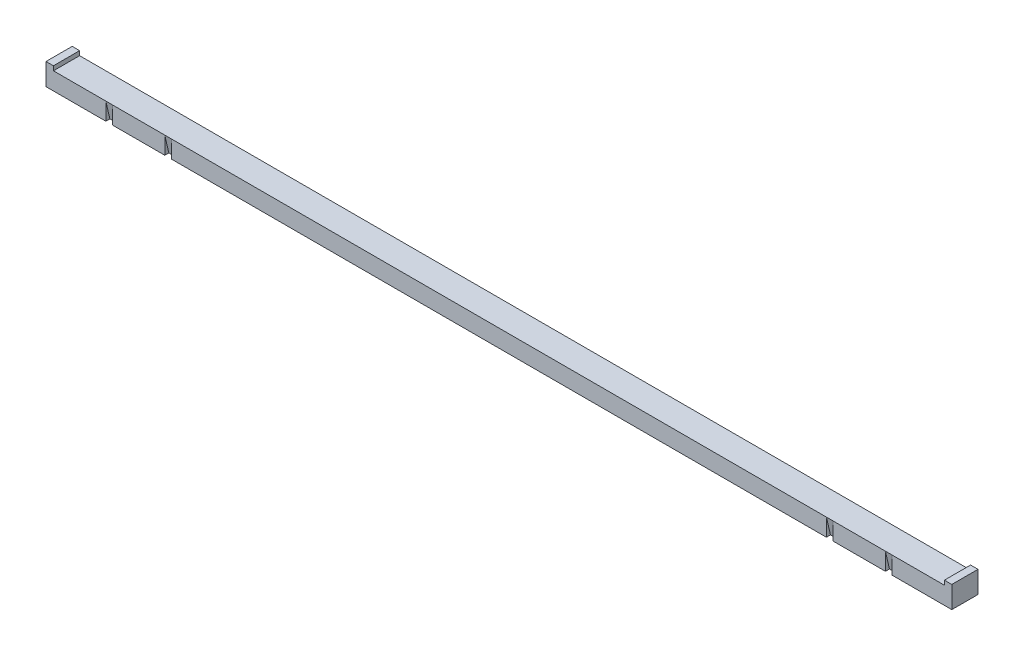
ISO-10303-21;
HEADER;
FILE_DESCRIPTION(('STEP AP214'),'2;1');
FILE_NAME('part.step','',(''),(''),'','','');
FILE_SCHEMA(('AUTOMOTIVE_DESIGN { 1 0 10303 214 1 1 1 1 }'));
ENDSEC;
DATA;
#1=APPLICATION_CONTEXT('core data for automotive mechanical design processes');
#2=APPLICATION_PROTOCOL_DEFINITION('international standard','automotive_design',2000,#1);
#3=PRODUCT_CONTEXT('',#1,'mechanical');
#4=PRODUCT('Part','Part','',(#3));
#5=PRODUCT_RELATED_PRODUCT_CATEGORY('part','',(#4));
#6=PRODUCT_DEFINITION_FORMATION('','',#4);
#7=PRODUCT_DEFINITION_CONTEXT('part definition',#1,'design');
#8=PRODUCT_DEFINITION('design','',#6,#7);
#9=PRODUCT_DEFINITION_SHAPE('','',#8);
#10=(LENGTH_UNIT() NAMED_UNIT(*) SI_UNIT(.MILLI.,.METRE.));
#11=(NAMED_UNIT(*) PLANE_ANGLE_UNIT() SI_UNIT($,.RADIAN.));
#12=(NAMED_UNIT(*) SI_UNIT($,.STERADIAN.) SOLID_ANGLE_UNIT());
#13=UNCERTAINTY_MEASURE_WITH_UNIT(LENGTH_MEASURE(1.E-05),#10,'distance_accuracy_value','');
#14=(GEOMETRIC_REPRESENTATION_CONTEXT(3) GLOBAL_UNCERTAINTY_ASSIGNED_CONTEXT((#13)) GLOBAL_UNIT_ASSIGNED_CONTEXT((#10,
#11,#12)) REPRESENTATION_CONTEXT('',''));
#15=CARTESIAN_POINT('',(0.,0.,0.));
#16=DIRECTION('',(0.,0.,1.));
#17=DIRECTION('',(1.,0.,0.));
#18=AXIS2_PLACEMENT_3D('',#15,#16,#17);
#19=CARTESIAN_POINT('',(0.,50.8,0.));
#20=DIRECTION('',(0.,1.,0.));
#21=DIRECTION('',(0.,0.,1.));
#22=AXIS2_PLACEMENT_3D('',#19,#20,#21);
#23=PLANE('',#22);
#24=DIRECTION('',(1.,0.,0.));
#25=VECTOR('',#24,1.);
#26=CARTESIAN_POINT('',(-1316.99,50.8,38.1));
#27=LINE('',#26,#25);
#28=CARTESIAN_POINT('',(1143.,50.8,38.1));
#29=VERTEX_POINT('',#28);
#30=CARTESIAN_POINT('',(1295.4,50.8,38.1));
#31=VERTEX_POINT('',#30);
#32=EDGE_CURVE('E55',#29,#31,#27,.T.);
#33=ORIENTED_EDGE('',*,*,#32,.T.);
#34=DIRECTION('',(0.,0.,1.));
#35=VECTOR('',#34,1.);
#36=CARTESIAN_POINT('',(1295.4,50.8,-38.1));
#37=LINE('',#36,#35);
#38=CARTESIAN_POINT('',(1295.4,50.8,-38.1));
#39=VERTEX_POINT('',#38);
#40=EDGE_CURVE('E50',#39,#31,#37,.T.);
#41=ORIENTED_EDGE('',*,*,#40,.F.);
#42=DIRECTION('',(-1.,0.,0.));
#43=VECTOR('',#42,1.);
#44=CARTESIAN_POINT('',(-1316.99,50.8,-38.1));
#45=LINE('',#44,#43);
#46=CARTESIAN_POINT('',(-1295.4,50.8,-38.1));
#47=VERTEX_POINT('',#46);
#48=EDGE_CURVE('E277',#39,#47,#45,.T.);
#49=ORIENTED_EDGE('',*,*,#48,.T.);
#50=DIRECTION('',(0.,0.,-1.));
#51=VECTOR('',#50,1.);
#52=CARTESIAN_POINT('',(-1295.4,50.8,-38.1));
#53=LINE('',#52,#51);
#54=CARTESIAN_POINT('',(-1295.4,50.8,38.1));
#55=VERTEX_POINT('',#54);
#56=EDGE_CURVE('E205',#55,#47,#53,.T.);
#57=ORIENTED_EDGE('',*,*,#56,.F.);
#58=CARTESIAN_POINT('',(-1143.,50.8,38.1));
#59=VERTEX_POINT('',#58);
#60=EDGE_CURVE('E280',#55,#59,#27,.T.);
#61=ORIENTED_EDGE('',*,*,#60,.T.);
#62=DIRECTION('',(-1.,0.,0.));
#63=VECTOR('',#62,1.);
#64=CARTESIAN_POINT('',(-1143.,50.8,38.1));
#65=LINE('',#64,#63);
#66=CARTESIAN_POINT('',(-1123.95,50.8,38.1));
#67=VERTEX_POINT('',#66);
#68=EDGE_CURVE('E228',#67,#59,#65,.T.);
#69=ORIENTED_EDGE('',*,*,#68,.F.);
#70=CARTESIAN_POINT('',(-971.55,50.8,38.1));
#71=VERTEX_POINT('',#70);
#72=EDGE_CURVE('E283',#67,#71,#27,.T.);
#73=ORIENTED_EDGE('',*,*,#72,.T.);
#74=DIRECTION('',(-1.,0.,0.));
#75=VECTOR('',#74,1.);
#76=CARTESIAN_POINT('',(-971.55,50.8,38.1));
#77=LINE('',#76,#75);
#78=CARTESIAN_POINT('',(-952.5,50.8,38.1));
#79=VERTEX_POINT('',#78);
#80=EDGE_CURVE('E238',#79,#71,#77,.T.);
#81=ORIENTED_EDGE('',*,*,#80,.F.);
#82=CARTESIAN_POINT('',(952.5,50.8,38.1));
#83=VERTEX_POINT('',#82);
#84=EDGE_CURVE('E381',#79,#83,#27,.T.);
#85=ORIENTED_EDGE('',*,*,#84,.T.);
#86=DIRECTION('',(-1.,0.,0.));
#87=VECTOR('',#86,1.);
#88=CARTESIAN_POINT('',(952.5,50.8,38.1));
#89=LINE('',#88,#87);
#90=CARTESIAN_POINT('',(971.55,50.8,38.1));
#91=VERTEX_POINT('',#90);
#92=EDGE_CURVE('E245',#91,#83,#89,.T.);
#93=ORIENTED_EDGE('',*,*,#92,.F.);
#94=CARTESIAN_POINT('',(1123.95,50.8,38.1));
#95=VERTEX_POINT('',#94);
#96=EDGE_CURVE('E383',#91,#95,#27,.T.);
#97=ORIENTED_EDGE('',*,*,#96,.T.);
#98=DIRECTION('',(-1.,0.,0.));
#99=VECTOR('',#98,1.);
#100=CARTESIAN_POINT('',(1123.95,50.8,38.1));
#101=LINE('',#100,#99);
#102=EDGE_CURVE('E251',#29,#95,#101,.T.);
#103=ORIENTED_EDGE('',*,*,#102,.F.);
#104=EDGE_LOOP('',(#33,#41,#49,#57,#61,#69,#73,#81,#85,#93,#97,#103));
#105=FACE_BOUND('',#104,.T.);
#106=ADVANCED_FACE('F35',(#105),#23,.T.);
#107=CARTESIAN_POINT('',(-1316.99,50.8,38.1));
#108=DIRECTION('',(0.,0.,-1.));
#109=DIRECTION('',(-1.,0.,0.));
#110=AXIS2_PLACEMENT_3D('',#107,#108,#109);
#111=PLANE('',#110);
#112=ORIENTED_EDGE('',*,*,#72,.F.);
#113=DIRECTION('',(0.,-1.,0.));
#114=VECTOR('',#113,1.);
#115=CARTESIAN_POINT('',(-1123.95,50.8,38.1));
#116=LINE('',#115,#114);
#117=CARTESIAN_POINT('',(-1123.95,0.,38.1));
#118=VERTEX_POINT('',#117);
#119=EDGE_CURVE('E274',#67,#118,#116,.T.);
#120=ORIENTED_EDGE('',*,*,#119,.T.);
#121=DIRECTION('',(1.,0.,0.));
#122=VECTOR('',#121,1.);
#123=CARTESIAN_POINT('',(-1316.99,0.,38.1));
#124=LINE('',#123,#122);
#125=CARTESIAN_POINT('',(-971.55,0.,38.1));
#126=VERTEX_POINT('',#125);
#127=EDGE_CURVE('E292',#118,#126,#124,.T.);
#128=ORIENTED_EDGE('',*,*,#127,.T.);
#129=DIRECTION('',(0.,1.,0.));
#130=VECTOR('',#129,1.);
#131=CARTESIAN_POINT('',(-971.55,50.8,38.1));
#132=LINE('',#131,#130);
#133=EDGE_CURVE('E265',#126,#71,#132,.T.);
#134=ORIENTED_EDGE('',*,*,#133,.T.);
#135=EDGE_LOOP('',(#112,#120,#128,#134));
#136=FACE_BOUND('',#135,.T.);
#137=ADVANCED_FACE('F367',(#136),#111,.F.);
#138=ORIENTED_EDGE('',*,*,#84,.F.);
#139=DIRECTION('',(0.,-1.,0.));
#140=VECTOR('',#139,1.);
#141=CARTESIAN_POINT('',(-952.5,50.8,38.1));
#142=LINE('',#141,#140);
#143=CARTESIAN_POINT('',(-952.5,0.,38.1));
#144=VERTEX_POINT('',#143);
#145=EDGE_CURVE('E268',#79,#144,#142,.T.);
#146=ORIENTED_EDGE('',*,*,#145,.T.);
#147=CARTESIAN_POINT('',(952.5,0.,38.1));
#148=VERTEX_POINT('',#147);
#149=EDGE_CURVE('E358',#144,#148,#124,.T.);
#150=ORIENTED_EDGE('',*,*,#149,.T.);
#151=DIRECTION('',(0.,1.,0.));
#152=VECTOR('',#151,1.);
#153=CARTESIAN_POINT('',(952.5,50.8,38.1));
#154=LINE('',#153,#152);
#155=EDGE_CURVE('E262',#148,#83,#154,.T.);
#156=ORIENTED_EDGE('',*,*,#155,.T.);
#157=EDGE_LOOP('',(#138,#146,#150,#156));
#158=FACE_BOUND('',#157,.T.);
#159=ADVANCED_FACE('F410',(#158),#111,.F.);
#160=CARTESIAN_POINT('',(-1316.99,0.,38.1));
#161=VERTEX_POINT('',#160);
#162=CARTESIAN_POINT('',(-1143.,0.,38.1));
#163=VERTEX_POINT('',#162);
#164=EDGE_CURVE('E279',#161,#163,#124,.T.);
#165=ORIENTED_EDGE('',*,*,#164,.T.);
#166=DIRECTION('',(0.,1.,0.));
#167=VECTOR('',#166,1.);
#168=CARTESIAN_POINT('',(-1143.,50.8,38.1));
#169=LINE('',#168,#167);
#170=EDGE_CURVE('E271',#163,#59,#169,.T.);
#171=ORIENTED_EDGE('',*,*,#170,.T.);
#172=ORIENTED_EDGE('',*,*,#60,.F.);
#173=DIRECTION('',(0.,-1.,0.));
#174=VECTOR('',#173,1.);
#175=CARTESIAN_POINT('',(-1295.4,63.5,38.1));
#176=LINE('',#175,#174);
#177=CARTESIAN_POINT('',(-1295.4,63.5,38.1));
#178=VERTEX_POINT('',#177);
#179=EDGE_CURVE('E221',#178,#55,#176,.T.);
#180=ORIENTED_EDGE('',*,*,#179,.F.);
#181=DIRECTION('',(1.,0.,0.));
#182=VECTOR('',#181,1.);
#183=CARTESIAN_POINT('',(-1295.4,63.5,38.1));
#184=LINE('',#183,#182);
#185=CARTESIAN_POINT('',(-1316.99,63.5,38.1));
#186=VERTEX_POINT('',#185);
#187=EDGE_CURVE('E209',#186,#178,#184,.T.);
#188=ORIENTED_EDGE('',*,*,#187,.F.);
#189=DIRECTION('',(0.,-1.,0.));
#190=VECTOR('',#189,1.);
#191=CARTESIAN_POINT('',(-1316.99,50.8,38.1));
#192=LINE('',#191,#190);
#193=EDGE_CURVE('E294',#186,#161,#192,.T.);
#194=ORIENTED_EDGE('',*,*,#193,.T.);
#195=EDGE_LOOP('',(#165,#171,#172,#180,#188,#194));
#196=FACE_BOUND('',#195,.T.);
#197=ADVANCED_FACE('F336',(#196),#111,.F.);
#198=ORIENTED_EDGE('',*,*,#96,.F.);
#199=DIRECTION('',(0.,-1.,0.));
#200=VECTOR('',#199,1.);
#201=CARTESIAN_POINT('',(971.55,50.8,38.1));
#202=LINE('',#201,#200);
#203=CARTESIAN_POINT('',(971.55,0.,38.1));
#204=VERTEX_POINT('',#203);
#205=EDGE_CURVE('E259',#91,#204,#202,.T.);
#206=ORIENTED_EDGE('',*,*,#205,.T.);
#207=CARTESIAN_POINT('',(1123.95,0.,38.1));
#208=VERTEX_POINT('',#207);
#209=EDGE_CURVE('E356',#204,#208,#124,.T.);
#210=ORIENTED_EDGE('',*,*,#209,.T.);
#211=DIRECTION('',(0.,1.,0.));
#212=VECTOR('',#211,1.);
#213=CARTESIAN_POINT('',(1123.95,50.8,38.1));
#214=LINE('',#213,#212);
#215=EDGE_CURVE('E256',#208,#95,#214,.T.);
#216=ORIENTED_EDGE('',*,*,#215,.T.);
#217=EDGE_LOOP('',(#198,#206,#210,#216));
#218=FACE_BOUND('',#217,.T.);
#219=ADVANCED_FACE('F386',(#218),#111,.F.);
#220=CARTESIAN_POINT('',(1316.99,50.8,-38.1));
#221=DIRECTION('',(-1.,0.,0.));
#222=DIRECTION('',(0.,0.,1.));
#223=AXIS2_PLACEMENT_3D('',#220,#221,#222);
#224=PLANE('',#223);
#225=DIRECTION('',(0.,0.,-1.));
#226=VECTOR('',#225,1.);
#227=CARTESIAN_POINT('',(1316.99,0.,-38.1));
#228=LINE('',#227,#226);
#229=CARTESIAN_POINT('',(1316.99,0.,38.1));
#230=VERTEX_POINT('',#229);
#231=CARTESIAN_POINT('',(1316.99,0.,-38.1));
#232=VERTEX_POINT('',#231);
#233=EDGE_CURVE('E178',#230,#232,#228,.T.);
#234=ORIENTED_EDGE('',*,*,#233,.T.);
#235=DIRECTION('',(0.,-1.,0.));
#236=VECTOR('',#235,1.);
#237=CARTESIAN_POINT('',(1316.99,50.8,-38.1));
#238=LINE('',#237,#236);
#239=CARTESIAN_POINT('',(1316.99,63.5,-38.1));
#240=VERTEX_POINT('',#239);
#241=EDGE_CURVE('E172',#240,#232,#238,.T.);
#242=ORIENTED_EDGE('',*,*,#241,.F.);
#243=DIRECTION('',(0.,0.,-1.));
#244=VECTOR('',#243,1.);
#245=CARTESIAN_POINT('',(1316.99,63.5,-38.1));
#246=LINE('',#245,#244);
#247=CARTESIAN_POINT('',(1316.99,63.5,38.1));
#248=VERTEX_POINT('',#247);
#249=EDGE_CURVE('E176',#248,#240,#246,.T.);
#250=ORIENTED_EDGE('',*,*,#249,.F.);
#251=DIRECTION('',(0.,-1.,0.));
#252=VECTOR('',#251,1.);
#253=CARTESIAN_POINT('',(1316.99,50.8,38.1));
#254=LINE('',#253,#252);
#255=EDGE_CURVE('E282',#248,#230,#254,.T.);
#256=ORIENTED_EDGE('',*,*,#255,.T.);
#257=EDGE_LOOP('',(#234,#242,#250,#256));
#258=FACE_BOUND('',#257,.T.);
#259=ADVANCED_FACE('F37',(#258),#224,.F.);
#260=CARTESIAN_POINT('',(-1316.99,50.8,-38.1));
#261=DIRECTION('',(0.,0.,1.));
#262=DIRECTION('',(1.,0.,0.));
#263=AXIS2_PLACEMENT_3D('',#260,#261,#262);
#264=PLANE('',#263);
#265=DIRECTION('',(-1.,0.,0.));
#266=VECTOR('',#265,1.);
#267=CARTESIAN_POINT('',(-1316.99,0.,-38.1));
#268=LINE('',#267,#266);
#269=CARTESIAN_POINT('',(-1316.99,0.,-38.1));
#270=VERTEX_POINT('',#269);
#271=EDGE_CURVE('E285',#232,#270,#268,.T.);
#272=ORIENTED_EDGE('',*,*,#271,.T.);
#273=DIRECTION('',(0.,-1.,0.));
#274=VECTOR('',#273,1.);
#275=CARTESIAN_POINT('',(-1316.99,50.8,-38.1));
#276=LINE('',#275,#274);
#277=CARTESIAN_POINT('',(-1316.99,63.5,-38.1));
#278=VERTEX_POINT('',#277);
#279=EDGE_CURVE('E181',#278,#270,#276,.T.);
#280=ORIENTED_EDGE('',*,*,#279,.F.);
#281=DIRECTION('',(-1.,0.,0.));
#282=VECTOR('',#281,1.);
#283=CARTESIAN_POINT('',(-1295.4,63.5,-38.1));
#284=LINE('',#283,#282);
#285=CARTESIAN_POINT('',(-1295.4,63.5,-38.1));
#286=VERTEX_POINT('',#285);
#287=EDGE_CURVE('E213',#286,#278,#284,.T.);
#288=ORIENTED_EDGE('',*,*,#287,.F.);
#289=DIRECTION('',(0.,-1.,0.));
#290=VECTOR('',#289,1.);
#291=CARTESIAN_POINT('',(-1295.4,63.5,-38.1));
#292=LINE('',#291,#290);
#293=EDGE_CURVE('E216',#286,#47,#292,.T.);
#294=ORIENTED_EDGE('',*,*,#293,.T.);
#295=ORIENTED_EDGE('',*,*,#48,.F.);
#296=DIRECTION('',(0.,-1.,0.));
#297=VECTOR('',#296,1.);
#298=CARTESIAN_POINT('',(1295.4,63.5,-38.1));
#299=LINE('',#298,#297);
#300=CARTESIAN_POINT('',(1295.4,63.5,-38.1));
#301=VERTEX_POINT('',#300);
#302=EDGE_CURVE('E187',#301,#39,#299,.T.);
#303=ORIENTED_EDGE('',*,*,#302,.F.);
#304=DIRECTION('',(-1.,0.,0.));
#305=VECTOR('',#304,1.);
#306=CARTESIAN_POINT('',(1295.4,63.5,-38.1));
#307=LINE('',#306,#305);
#308=EDGE_CURVE('E184',#240,#301,#307,.T.);
#309=ORIENTED_EDGE('',*,*,#308,.F.);
#310=ORIENTED_EDGE('',*,*,#241,.T.);
#311=EDGE_LOOP('',(#272,#280,#288,#294,#295,#303,#309,#310));
#312=FACE_BOUND('',#311,.T.);
#313=ADVANCED_FACE('F185',(#312),#264,.F.);
#314=CARTESIAN_POINT('',(-1316.99,50.8,-38.1));
#315=DIRECTION('',(1.,0.,0.));
#316=DIRECTION('',(0.,0.,-1.));
#317=AXIS2_PLACEMENT_3D('',#314,#315,#316);
#318=PLANE('',#317);
#319=DIRECTION('',(0.,0.,1.));
#320=VECTOR('',#319,1.);
#321=CARTESIAN_POINT('',(-1316.99,0.,-38.1));
#322=LINE('',#321,#320);
#323=EDGE_CURVE('E287',#270,#161,#322,.T.);
#324=ORIENTED_EDGE('',*,*,#323,.T.);
#325=ORIENTED_EDGE('',*,*,#193,.F.);
#326=DIRECTION('',(0.,0.,1.));
#327=VECTOR('',#326,1.);
#328=CARTESIAN_POINT('',(-1316.99,63.5,-38.1));
#329=LINE('',#328,#327);
#330=EDGE_CURVE('E206',#278,#186,#329,.T.);
#331=ORIENTED_EDGE('',*,*,#330,.F.);
#332=ORIENTED_EDGE('',*,*,#279,.T.);
#333=EDGE_LOOP('',(#324,#325,#331,#332));
#334=FACE_BOUND('',#333,.T.);
#335=ADVANCED_FACE('F342',(#334),#318,.F.);
#336=ORIENTED_EDGE('',*,*,#32,.F.);
#337=DIRECTION('',(0.,-1.,0.));
#338=VECTOR('',#337,1.);
#339=CARTESIAN_POINT('',(1143.,50.8,38.1));
#340=LINE('',#339,#338);
#341=CARTESIAN_POINT('',(1143.,0.,38.1));
#342=VERTEX_POINT('',#341);
#343=EDGE_CURVE('E234',#29,#342,#340,.T.);
#344=ORIENTED_EDGE('',*,*,#343,.T.);
#345=EDGE_CURVE('E289',#342,#230,#124,.T.);
#346=ORIENTED_EDGE('',*,*,#345,.T.);
#347=ORIENTED_EDGE('',*,*,#255,.F.);
#348=DIRECTION('',(1.,0.,0.));
#349=VECTOR('',#348,1.);
#350=CARTESIAN_POINT('',(1295.4,63.5,38.1));
#351=LINE('',#350,#349);
#352=CARTESIAN_POINT('',(1295.4,63.5,38.1));
#353=VERTEX_POINT('',#352);
#354=EDGE_CURVE('E195',#353,#248,#351,.T.);
#355=ORIENTED_EDGE('',*,*,#354,.F.);
#356=DIRECTION('',(0.,-1.,0.));
#357=VECTOR('',#356,1.);
#358=CARTESIAN_POINT('',(1295.4,63.5,38.1));
#359=LINE('',#358,#357);
#360=EDGE_CURVE('E200',#353,#31,#359,.T.);
#361=ORIENTED_EDGE('',*,*,#360,.T.);
#362=EDGE_LOOP('',(#336,#344,#346,#347,#355,#361));
#363=FACE_BOUND('',#362,.T.);
#364=ADVANCED_FACE('F355',(#363),#111,.F.);
#365=CARTESIAN_POINT('',(0.,0.,0.));
#366=DIRECTION('',(0.,1.,0.));
#367=DIRECTION('',(0.,0.,1.));
#368=AXIS2_PLACEMENT_3D('',#365,#366,#367);
#369=PLANE('',#368);
#370=ORIENTED_EDGE('',*,*,#127,.F.);
#371=DIRECTION('',(0.,0.,-1.));
#372=VECTOR('',#371,1.);
#373=CARTESIAN_POINT('',(-1123.95,0.,0.));
#374=LINE('',#373,#372);
#375=CARTESIAN_POINT('',(-1123.95,0.,26.3718958908212));
#376=VERTEX_POINT('',#375);
#377=EDGE_CURVE('E11',#118,#376,#374,.T.);
#378=ORIENTED_EDGE('',*,*,#377,.T.);
#379=DIRECTION('',(1.,0.,0.));
#380=VECTOR('',#379,1.);
#381=CARTESIAN_POINT('',(0.,0.,26.3718958908212));
#382=LINE('',#381,#380);
#383=CARTESIAN_POINT('',(-1143.,0.,26.3718958908212));
#384=VERTEX_POINT('',#383);
#385=EDGE_CURVE('E324',#384,#376,#382,.T.);
#386=ORIENTED_EDGE('',*,*,#385,.F.);
#387=DIRECTION('',(0.,0.,1.));
#388=VECTOR('',#387,1.);
#389=CARTESIAN_POINT('',(-1143.,0.,0.));
#390=LINE('',#389,#388);
#391=EDGE_CURVE('E43',#384,#163,#390,.T.);
#392=ORIENTED_EDGE('',*,*,#391,.T.);
#393=ORIENTED_EDGE('',*,*,#164,.F.);
#394=ORIENTED_EDGE('',*,*,#323,.F.);
#395=ORIENTED_EDGE('',*,*,#271,.F.);
#396=ORIENTED_EDGE('',*,*,#233,.F.);
#397=ORIENTED_EDGE('',*,*,#345,.F.);
#398=DIRECTION('',(0.,0.,-1.));
#399=VECTOR('',#398,1.);
#400=CARTESIAN_POINT('',(1143.,0.,0.));
#401=LINE('',#400,#399);
#402=CARTESIAN_POINT('',(1143.,0.,26.3718958908212));
#403=VERTEX_POINT('',#402);
#404=EDGE_CURVE('E301',#342,#403,#401,.T.);
#405=ORIENTED_EDGE('',*,*,#404,.T.);
#406=DIRECTION('',(-1.,0.,0.));
#407=VECTOR('',#406,1.);
#408=CARTESIAN_POINT('',(0.,0.,26.3718958908212));
#409=LINE('',#408,#407);
#410=CARTESIAN_POINT('',(1123.95,0.,26.3718958908212));
#411=VERTEX_POINT('',#410);
#412=EDGE_CURVE('E180',#403,#411,#409,.T.);
#413=ORIENTED_EDGE('',*,*,#412,.T.);
#414=DIRECTION('',(0.,0.,1.));
#415=VECTOR('',#414,1.);
#416=CARTESIAN_POINT('',(1123.95,0.,0.));
#417=LINE('',#416,#415);
#418=EDGE_CURVE('E304',#411,#208,#417,.T.);
#419=ORIENTED_EDGE('',*,*,#418,.T.);
#420=ORIENTED_EDGE('',*,*,#209,.F.);
#421=DIRECTION('',(0.,0.,-1.));
#422=VECTOR('',#421,1.);
#423=CARTESIAN_POINT('',(971.55,0.,0.));
#424=LINE('',#423,#422);
#425=CARTESIAN_POINT('',(971.55,0.,26.3718958908212));
#426=VERTEX_POINT('',#425);
#427=EDGE_CURVE('E310',#204,#426,#424,.T.);
#428=ORIENTED_EDGE('',*,*,#427,.T.);
#429=DIRECTION('',(-1.,0.,0.));
#430=VECTOR('',#429,1.);
#431=CARTESIAN_POINT('',(0.,0.,26.3718958908212));
#432=LINE('',#431,#430);
#433=CARTESIAN_POINT('',(952.5,0.,26.3718958908212));
#434=VERTEX_POINT('',#433);
#435=EDGE_CURVE('E307',#426,#434,#432,.T.);
#436=ORIENTED_EDGE('',*,*,#435,.T.);
#437=DIRECTION('',(0.,0.,1.));
#438=VECTOR('',#437,1.);
#439=CARTESIAN_POINT('',(952.5,0.,0.));
#440=LINE('',#439,#438);
#441=EDGE_CURVE('E313',#434,#148,#440,.T.);
#442=ORIENTED_EDGE('',*,*,#441,.T.);
#443=ORIENTED_EDGE('',*,*,#149,.F.);
#444=DIRECTION('',(0.,0.,-1.));
#445=VECTOR('',#444,1.);
#446=CARTESIAN_POINT('',(-952.5,0.,0.));
#447=LINE('',#446,#445);
#448=CARTESIAN_POINT('',(-952.5,0.,26.3718958908212));
#449=VERTEX_POINT('',#448);
#450=EDGE_CURVE('E321',#144,#449,#447,.T.);
#451=ORIENTED_EDGE('',*,*,#450,.T.);
#452=DIRECTION('',(1.,0.,0.));
#453=VECTOR('',#452,1.);
#454=CARTESIAN_POINT('',(0.,0.,26.3718958908212));
#455=LINE('',#454,#453);
#456=CARTESIAN_POINT('',(-971.55,0.,26.3718958908212));
#457=VERTEX_POINT('',#456);
#458=EDGE_CURVE('E316',#457,#449,#455,.T.);
#459=ORIENTED_EDGE('',*,*,#458,.F.);
#460=DIRECTION('',(0.,0.,1.));
#461=VECTOR('',#460,1.);
#462=CARTESIAN_POINT('',(-971.55,0.,0.));
#463=LINE('',#462,#461);
#464=EDGE_CURVE('E318',#457,#126,#463,.T.);
#465=ORIENTED_EDGE('',*,*,#464,.T.);
#466=EDGE_LOOP('',(#370,#378,#386,#392,#393,#394,#395,#396,#397,#405,#413,#419,#420,#428,#436,
#442,#443,#451,#459,#465));
#467=FACE_BOUND('',#466,.T.);
#468=ADVANCED_FACE('F331',(#467),#369,.F.);
#469=CARTESIAN_POINT('',(1123.95,50.8,38.1));
#470=DIRECTION('',(-1.,0.,0.));
#471=DIRECTION('',(0.,0.,1.));
#472=AXIS2_PLACEMENT_3D('',#469,#470,#471);
#473=PLANE('',#472);
#474=ORIENTED_EDGE('',*,*,#418,.F.);
#475=DIRECTION('',(0.,-0.974370064785234,-0.224951054343869));
#476=VECTOR('',#475,1.);
#477=CARTESIAN_POINT('',(1123.95,50.8,38.1));
#478=LINE('',#477,#476);
#479=EDGE_CURVE('E246',#95,#411,#478,.T.);
#480=ORIENTED_EDGE('',*,*,#479,.F.);
#481=ORIENTED_EDGE('',*,*,#215,.F.);
#482=EDGE_LOOP('',(#474,#480,#481));
#483=FACE_BOUND('',#482,.T.);
#484=ADVANCED_FACE('F390',(#483),#473,.F.);
#485=CARTESIAN_POINT('',(1143.,50.8,38.1));
#486=DIRECTION('',(1.,0.,0.));
#487=DIRECTION('',(0.,0.,-1.));
#488=AXIS2_PLACEMENT_3D('',#485,#486,#487);
#489=PLANE('',#488);
#490=DIRECTION('',(0.,0.974370064785234,0.224951054343869));
#491=VECTOR('',#490,1.);
#492=CARTESIAN_POINT('',(1143.,50.8,38.1));
#493=LINE('',#492,#491);
#494=EDGE_CURVE('E224',#403,#29,#493,.T.);
#495=ORIENTED_EDGE('',*,*,#494,.F.);
#496=ORIENTED_EDGE('',*,*,#404,.F.);
#497=ORIENTED_EDGE('',*,*,#343,.F.);
#498=EDGE_LOOP('',(#495,#496,#497));
#499=FACE_BOUND('',#498,.T.);
#500=ADVANCED_FACE('F395',(#499),#489,.F.);
#501=CARTESIAN_POINT('',(0.,87.9234994683174,46.6706351705014));
#502=DIRECTION('',(0.,0.224951054343869,-0.974370064785234));
#503=DIRECTION('',(0.,0.974370064785234,0.224951054343869));
#504=AXIS2_PLACEMENT_3D('',#501,#502,#503);
#505=PLANE('',#504);
#506=ORIENTED_EDGE('',*,*,#494,.T.);
#507=ORIENTED_EDGE('',*,*,#102,.T.);
#508=ORIENTED_EDGE('',*,*,#479,.T.);
#509=ORIENTED_EDGE('',*,*,#412,.F.);
#510=EDGE_LOOP('',(#506,#507,#508,#509));
#511=FACE_BOUND('',#510,.T.);
#512=ADVANCED_FACE('F393',(#511),#505,.F.);
#513=CARTESIAN_POINT('',(952.5,50.8,38.1));
#514=DIRECTION('',(-1.,0.,0.));
#515=DIRECTION('',(0.,0.,1.));
#516=AXIS2_PLACEMENT_3D('',#513,#514,#515);
#517=PLANE('',#516);
#518=ORIENTED_EDGE('',*,*,#441,.F.);
#519=DIRECTION('',(0.,-0.974370064785234,-0.224951054343869));
#520=VECTOR('',#519,1.);
#521=CARTESIAN_POINT('',(952.5,50.8,38.1));
#522=LINE('',#521,#520);
#523=EDGE_CURVE('E239',#83,#434,#522,.T.);
#524=ORIENTED_EDGE('',*,*,#523,.F.);
#525=ORIENTED_EDGE('',*,*,#155,.F.);
#526=EDGE_LOOP('',(#518,#524,#525));
#527=FACE_BOUND('',#526,.T.);
#528=ADVANCED_FACE('F402',(#527),#517,.F.);
#529=CARTESIAN_POINT('',(971.55,50.8,38.1));
#530=DIRECTION('',(1.,0.,0.));
#531=DIRECTION('',(0.,0.,-1.));
#532=AXIS2_PLACEMENT_3D('',#529,#530,#531);
#533=PLANE('',#532);
#534=DIRECTION('',(0.,0.974370064785234,0.224951054343869));
#535=VECTOR('',#534,1.);
#536=CARTESIAN_POINT('',(971.55,50.8,38.1));
#537=LINE('',#536,#535);
#538=EDGE_CURVE('E242',#426,#91,#537,.T.);
#539=ORIENTED_EDGE('',*,*,#538,.F.);
#540=ORIENTED_EDGE('',*,*,#427,.F.);
#541=ORIENTED_EDGE('',*,*,#205,.F.);
#542=EDGE_LOOP('',(#539,#540,#541));
#543=FACE_BOUND('',#542,.T.);
#544=ADVANCED_FACE('F439',(#543),#533,.F.);
#545=CARTESIAN_POINT('',(0.,87.9234994683174,46.6706351705014));
#546=DIRECTION('',(0.,0.224951054343869,-0.974370064785234));
#547=DIRECTION('',(0.,0.974370064785234,0.224951054343869));
#548=AXIS2_PLACEMENT_3D('',#545,#546,#547);
#549=PLANE('',#548);
#550=ORIENTED_EDGE('',*,*,#538,.T.);
#551=ORIENTED_EDGE('',*,*,#92,.T.);
#552=ORIENTED_EDGE('',*,*,#523,.T.);
#553=ORIENTED_EDGE('',*,*,#435,.F.);
#554=EDGE_LOOP('',(#550,#551,#552,#553));
#555=FACE_BOUND('',#554,.T.);
#556=ADVANCED_FACE('F437',(#555),#549,.F.);
#557=CARTESIAN_POINT('',(-952.5,50.8,38.1));
#558=DIRECTION('',(1.,0.,0.));
#559=DIRECTION('',(0.,0.,-1.));
#560=AXIS2_PLACEMENT_3D('',#557,#558,#559);
#561=PLANE('',#560);
#562=DIRECTION('',(0.,0.974370064785234,0.224951054343869));
#563=VECTOR('',#562,1.);
#564=CARTESIAN_POINT('',(-952.5,50.8,38.1));
#565=LINE('',#564,#563);
#566=EDGE_CURVE('E235',#449,#79,#565,.T.);
#567=ORIENTED_EDGE('',*,*,#566,.F.);
#568=ORIENTED_EDGE('',*,*,#450,.F.);
#569=ORIENTED_EDGE('',*,*,#145,.F.);
#570=EDGE_LOOP('',(#567,#568,#569));
#571=FACE_BOUND('',#570,.T.);
#572=ADVANCED_FACE('F446',(#571),#561,.F.);
#573=CARTESIAN_POINT('',(-971.55,50.8,38.1));
#574=DIRECTION('',(-1.,0.,0.));
#575=DIRECTION('',(0.,0.,1.));
#576=AXIS2_PLACEMENT_3D('',#573,#574,#575);
#577=PLANE('',#576);
#578=ORIENTED_EDGE('',*,*,#464,.F.);
#579=DIRECTION('',(0.,-0.974370064785234,-0.224951054343869));
#580=VECTOR('',#579,1.);
#581=CARTESIAN_POINT('',(-971.55,50.8,38.1));
#582=LINE('',#581,#580);
#583=EDGE_CURVE('E229',#71,#457,#582,.T.);
#584=ORIENTED_EDGE('',*,*,#583,.F.);
#585=ORIENTED_EDGE('',*,*,#133,.F.);
#586=EDGE_LOOP('',(#578,#584,#585));
#587=FACE_BOUND('',#586,.T.);
#588=ADVANCED_FACE('F373',(#587),#577,.F.);
#589=CARTESIAN_POINT('',(0.,87.9234994683174,46.6706351705014));
#590=DIRECTION('',(0.,-0.224951054343869,0.974370064785234));
#591=DIRECTION('',(0.,-0.974370064785234,-0.224951054343869));
#592=AXIS2_PLACEMENT_3D('',#589,#590,#591);
#593=PLANE('',#592);
#594=ORIENTED_EDGE('',*,*,#458,.T.);
#595=ORIENTED_EDGE('',*,*,#566,.T.);
#596=ORIENTED_EDGE('',*,*,#80,.T.);
#597=ORIENTED_EDGE('',*,*,#583,.T.);
#598=EDGE_LOOP('',(#594,#595,#596,#597));
#599=FACE_BOUND('',#598,.T.);
#600=ADVANCED_FACE('F375',(#599),#593,.T.);
#601=CARTESIAN_POINT('',(-1123.95,50.8,38.1));
#602=DIRECTION('',(1.,0.,0.));
#603=DIRECTION('',(0.,0.,-1.));
#604=AXIS2_PLACEMENT_3D('',#601,#602,#603);
#605=PLANE('',#604);
#606=DIRECTION('',(0.,0.974370064785234,0.224951054343869));
#607=VECTOR('',#606,1.);
#608=CARTESIAN_POINT('',(-1123.95,50.8,38.1));
#609=LINE('',#608,#607);
#610=EDGE_CURVE('E225',#376,#67,#609,.T.);
#611=ORIENTED_EDGE('',*,*,#610,.F.);
#612=ORIENTED_EDGE('',*,*,#377,.F.);
#613=ORIENTED_EDGE('',*,*,#119,.F.);
#614=EDGE_LOOP('',(#611,#612,#613));
#615=FACE_BOUND('',#614,.T.);
#616=ADVANCED_FACE('F457',(#615),#605,.F.);
#617=CARTESIAN_POINT('',(-1143.,50.8,38.1));
#618=DIRECTION('',(-1.,0.,0.));
#619=DIRECTION('',(0.,0.,1.));
#620=AXIS2_PLACEMENT_3D('',#617,#618,#619);
#621=PLANE('',#620);
#622=ORIENTED_EDGE('',*,*,#391,.F.);
#623=DIRECTION('',(0.,-0.974370064785234,-0.224951054343869));
#624=VECTOR('',#623,1.);
#625=CARTESIAN_POINT('',(-1143.,50.8,38.1));
#626=LINE('',#625,#624);
#627=EDGE_CURVE('E232',#59,#384,#626,.T.);
#628=ORIENTED_EDGE('',*,*,#627,.F.);
#629=ORIENTED_EDGE('',*,*,#170,.F.);
#630=EDGE_LOOP('',(#622,#628,#629));
#631=FACE_BOUND('',#630,.T.);
#632=ADVANCED_FACE('F458',(#631),#621,.F.);
#633=CARTESIAN_POINT('',(0.,87.9234994683174,46.6706351705014));
#634=DIRECTION('',(0.,-0.224951054343869,0.974370064785234));
#635=DIRECTION('',(0.,-0.974370064785234,-0.224951054343869));
#636=AXIS2_PLACEMENT_3D('',#633,#634,#635);
#637=PLANE('',#636);
#638=ORIENTED_EDGE('',*,*,#385,.T.);
#639=ORIENTED_EDGE('',*,*,#610,.T.);
#640=ORIENTED_EDGE('',*,*,#68,.T.);
#641=ORIENTED_EDGE('',*,*,#627,.T.);
#642=EDGE_LOOP('',(#638,#639,#640,#641));
#643=FACE_BOUND('',#642,.T.);
#644=ADVANCED_FACE('F461',(#643),#637,.T.);
#645=CARTESIAN_POINT('',(-1295.4,63.5,-38.1));
#646=DIRECTION('',(-1.,0.,0.));
#647=DIRECTION('',(0.,0.,1.));
#648=AXIS2_PLACEMENT_3D('',#645,#646,#647);
#649=PLANE('',#648);
#650=ORIENTED_EDGE('',*,*,#56,.T.);
#651=ORIENTED_EDGE('',*,*,#293,.F.);
#652=DIRECTION('',(0.,0.,-1.));
#653=VECTOR('',#652,1.);
#654=CARTESIAN_POINT('',(-1295.4,63.5,-38.1));
#655=LINE('',#654,#653);
#656=EDGE_CURVE('E211',#178,#286,#655,.T.);
#657=ORIENTED_EDGE('',*,*,#656,.F.);
#658=ORIENTED_EDGE('',*,*,#179,.T.);
#659=EDGE_LOOP('',(#650,#651,#657,#658));
#660=FACE_BOUND('',#659,.T.);
#661=ADVANCED_FACE('F350',(#660),#649,.F.);
#662=CARTESIAN_POINT('',(0.,63.5,0.));
#663=DIRECTION('',(0.,-1.,0.));
#664=DIRECTION('',(0.,0.,-1.));
#665=AXIS2_PLACEMENT_3D('',#662,#663,#664);
#666=PLANE('',#665);
#667=ORIENTED_EDGE('',*,*,#330,.T.);
#668=ORIENTED_EDGE('',*,*,#187,.T.);
#669=ORIENTED_EDGE('',*,*,#656,.T.);
#670=ORIENTED_EDGE('',*,*,#287,.T.);
#671=EDGE_LOOP('',(#667,#668,#669,#670));
#672=FACE_BOUND('',#671,.T.);
#673=ADVANCED_FACE('F346',(#672),#666,.F.);
#674=CARTESIAN_POINT('',(1295.4,63.5,-38.1));
#675=DIRECTION('',(1.,0.,0.));
#676=DIRECTION('',(0.,0.,-1.));
#677=AXIS2_PLACEMENT_3D('',#674,#675,#676);
#678=PLANE('',#677);
#679=ORIENTED_EDGE('',*,*,#40,.T.);
#680=ORIENTED_EDGE('',*,*,#360,.F.);
#681=DIRECTION('',(0.,0.,1.));
#682=VECTOR('',#681,1.);
#683=CARTESIAN_POINT('',(1295.4,63.5,-38.1));
#684=LINE('',#683,#682);
#685=EDGE_CURVE('E190',#301,#353,#684,.T.);
#686=ORIENTED_EDGE('',*,*,#685,.F.);
#687=ORIENTED_EDGE('',*,*,#302,.T.);
#688=EDGE_LOOP('',(#679,#680,#686,#687));
#689=FACE_BOUND('',#688,.T.);
#690=ADVANCED_FACE('F352',(#689),#678,.F.);
#691=CARTESIAN_POINT('',(0.,63.5,0.));
#692=DIRECTION('',(0.,1.,0.));
#693=DIRECTION('',(0.,0.,1.));
#694=AXIS2_PLACEMENT_3D('',#691,#692,#693);
#695=PLANE('',#694);
#696=ORIENTED_EDGE('',*,*,#249,.T.);
#697=ORIENTED_EDGE('',*,*,#308,.T.);
#698=ORIENTED_EDGE('',*,*,#685,.T.);
#699=ORIENTED_EDGE('',*,*,#354,.T.);
#700=EDGE_LOOP('',(#696,#697,#698,#699));
#701=FACE_BOUND('',#700,.T.);
#702=ADVANCED_FACE('F193',(#701),#695,.T.);
#703=CLOSED_SHELL('',(#106,#137,#159,#197,#219,#259,#313,#335,#364,#468,#484,#500,#512,#528,
#544,#556,#572,#588,#600,#616,#632,#644,#661,#673,#690,#702));
#704=MANIFOLD_SOLID_BREP('B2',#703);
#705=ADVANCED_BREP_SHAPE_REPRESENTATION('',(#18,#704),#14);
#706=SHAPE_DEFINITION_REPRESENTATION(#9,#705);
ENDSEC;
END-ISO-10303-21;
